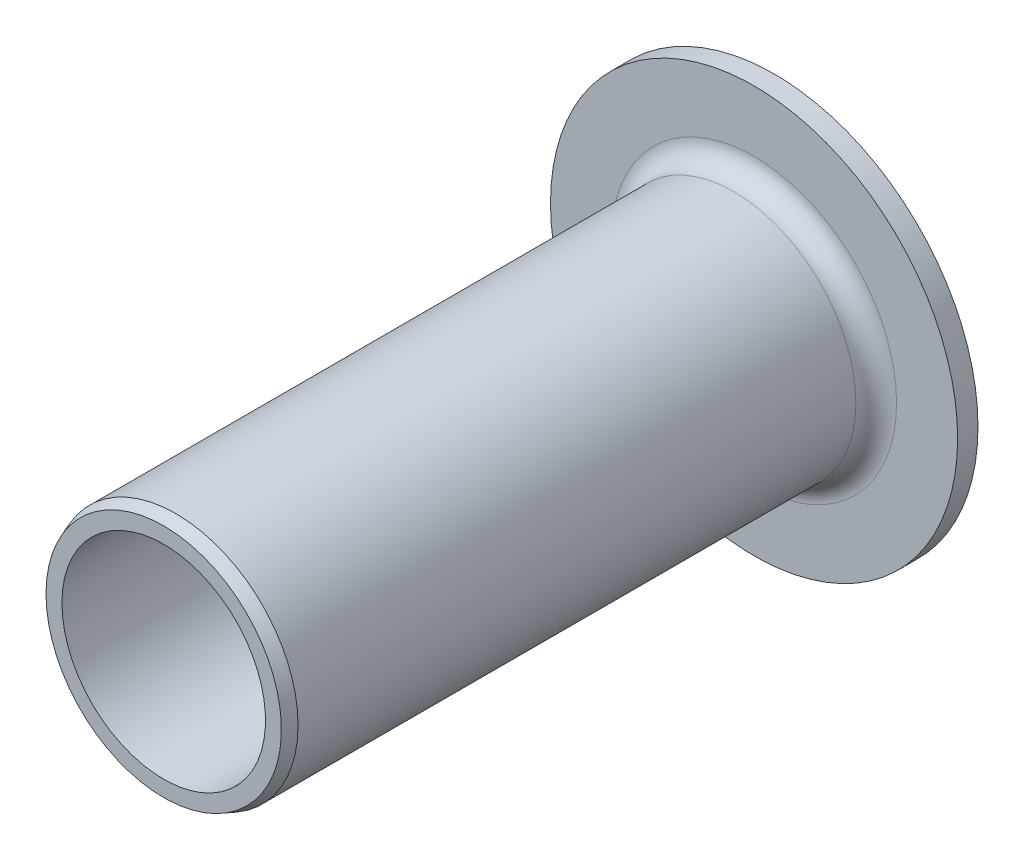
ISO-10303-21;
HEADER;
FILE_DESCRIPTION(('STEP AP214'),'2;1');
FILE_NAME('part.step','',(''),(''),'','','');
FILE_SCHEMA(('AUTOMOTIVE_DESIGN { 1 0 10303 214 1 1 1 1 }'));
ENDSEC;
DATA;
#1=APPLICATION_CONTEXT('core data for automotive mechanical design processes');
#2=APPLICATION_PROTOCOL_DEFINITION('international standard','automotive_design',2000,#1);
#3=PRODUCT_CONTEXT('',#1,'mechanical');
#4=PRODUCT('Part','Part','',(#3));
#5=PRODUCT_RELATED_PRODUCT_CATEGORY('part','',(#4));
#6=PRODUCT_DEFINITION_FORMATION('','',#4);
#7=PRODUCT_DEFINITION_CONTEXT('part definition',#1,'design');
#8=PRODUCT_DEFINITION('design','',#6,#7);
#9=PRODUCT_DEFINITION_SHAPE('','',#8);
#10=(LENGTH_UNIT() NAMED_UNIT(*) SI_UNIT(.MILLI.,.METRE.));
#11=(NAMED_UNIT(*) PLANE_ANGLE_UNIT() SI_UNIT($,.RADIAN.));
#12=(NAMED_UNIT(*) SI_UNIT($,.STERADIAN.) SOLID_ANGLE_UNIT());
#13=UNCERTAINTY_MEASURE_WITH_UNIT(LENGTH_MEASURE(1.E-05),#10,'distance_accuracy_value','');
#14=(GEOMETRIC_REPRESENTATION_CONTEXT(3) GLOBAL_UNCERTAINTY_ASSIGNED_CONTEXT((#13)) GLOBAL_UNIT_ASSIGNED_CONTEXT((#10,
#11,#12)) REPRESENTATION_CONTEXT('',''));
#15=CARTESIAN_POINT('',(0.,0.,0.));
#16=DIRECTION('',(0.,0.,1.));
#17=DIRECTION('',(1.,0.,0.));
#18=AXIS2_PLACEMENT_3D('',#15,#16,#17);
#19=CARTESIAN_POINT('',(3.75,0.,0.));
#20=DIRECTION('',(0.,0.,-1.));
#21=DIRECTION('',(-1.,0.,0.));
#22=AXIS2_PLACEMENT_3D('',#19,#20,#21);
#23=PLANE('',#22);
#24=CARTESIAN_POINT('',(0.,0.,0.));
#25=DIRECTION('',(0.,0.,-1.));
#26=DIRECTION('',(-1.,0.,0.));
#27=AXIS2_PLACEMENT_3D('',#24,#25,#26);
#28=CIRCLE('',#27,2.5);
#29=CARTESIAN_POINT('',(-2.5,0.,0.));
#30=VERTEX_POINT('',#29);
#31=EDGE_CURVE('E114',#30,#30,#28,.F.);
#32=ORIENTED_EDGE('',*,*,#31,.T.);
#33=EDGE_LOOP('',(#32));
#34=FACE_BOUND('',#33,.T.);
#35=CARTESIAN_POINT('',(0.,0.,0.));
#36=DIRECTION('',(0.,0.,-1.));
#37=DIRECTION('',(-1.,0.,0.));
#38=AXIS2_PLACEMENT_3D('',#35,#36,#37);
#39=CIRCLE('',#38,5.);
#40=CARTESIAN_POINT('',(-5.,0.,0.));
#41=VERTEX_POINT('',#40);
#42=EDGE_CURVE('E117',#41,#41,#39,.F.);
#43=ORIENTED_EDGE('',*,*,#42,.F.);
#44=EDGE_LOOP('',(#43));
#45=FACE_BOUND('',#44,.T.);
#46=ADVANCED_FACE('F15',(#34,#45),#23,.T.);
#47=CARTESIAN_POINT('',(0.,0.,0.25));
#48=DIRECTION('',(0.,0.,-1.));
#49=DIRECTION('',(-1.,0.,0.));
#50=AXIS2_PLACEMENT_3D('',#47,#48,#49);
#51=CYLINDRICAL_SURFACE('',#50,5.);
#52=CARTESIAN_POINT('',(0.,0.,0.5));
#53=DIRECTION('',(0.,0.,-1.));
#54=DIRECTION('',(-1.,0.,0.));
#55=AXIS2_PLACEMENT_3D('',#52,#53,#54);
#56=CIRCLE('',#55,5.);
#57=CARTESIAN_POINT('',(-5.,0.,0.5));
#58=VERTEX_POINT('',#57);
#59=EDGE_CURVE('E40',#58,#58,#56,.F.);
#60=ORIENTED_EDGE('',*,*,#59,.F.);
#61=EDGE_LOOP('',(#60));
#62=FACE_BOUND('',#61,.T.);
#63=ORIENTED_EDGE('',*,*,#42,.T.);
#64=EDGE_LOOP('',(#63));
#65=FACE_BOUND('',#64,.T.);
#66=ADVANCED_FACE('F84',(#62,#65),#51,.T.);
#67=CARTESIAN_POINT('',(0.,0.,7.5));
#68=DIRECTION('',(0.,0.,-1.));
#69=DIRECTION('',(-1.,0.,0.));
#70=AXIS2_PLACEMENT_3D('',#67,#68,#69);
#71=CYLINDRICAL_SURFACE('',#70,2.5);
#72=ORIENTED_EDGE('',*,*,#31,.F.);
#73=EDGE_LOOP('',(#72));
#74=FACE_BOUND('',#73,.T.);
#75=CARTESIAN_POINT('',(0.,0.,15.));
#76=DIRECTION('',(0.,0.,-1.));
#77=DIRECTION('',(-1.,0.,0.));
#78=AXIS2_PLACEMENT_3D('',#75,#76,#77);
#79=CIRCLE('',#78,2.5);
#80=CARTESIAN_POINT('',(-2.5,0.,15.));
#81=VERTEX_POINT('',#80);
#82=EDGE_CURVE('E39',#81,#81,#79,.T.);
#83=ORIENTED_EDGE('',*,*,#82,.F.);
#84=EDGE_LOOP('',(#83));
#85=FACE_BOUND('',#84,.T.);
#86=ADVANCED_FACE('F80',(#74,#85),#71,.F.);
#87=CARTESIAN_POINT('',(4.25,0.,0.5));
#88=DIRECTION('',(0.,0.,1.));
#89=DIRECTION('',(1.,0.,0.));
#90=AXIS2_PLACEMENT_3D('',#87,#88,#89);
#91=PLANE('',#90);
#92=ORIENTED_EDGE('',*,*,#59,.T.);
#93=EDGE_LOOP('',(#92));
#94=FACE_BOUND('',#93,.T.);
#95=CARTESIAN_POINT('',(0.,0.,0.499999999999999));
#96=DIRECTION('',(0.,0.,1.));
#97=DIRECTION('',(1.,0.,0.));
#98=AXIS2_PLACEMENT_3D('',#95,#96,#97);
#99=CIRCLE('',#98,3.5);
#100=CARTESIAN_POINT('',(-3.5,0.,0.499999999999999));
#101=VERTEX_POINT('',#100);
#102=CARTESIAN_POINT('',(3.5,0.,0.499999999999999));
#103=VERTEX_POINT('',#102);
#104=EDGE_CURVE('E32',#101,#103,#99,.F.);
#105=ORIENTED_EDGE('',*,*,#104,.T.);
#106=CARTESIAN_POINT('',(0.,0.,0.499999999999999));
#107=DIRECTION('',(0.,0.,1.));
#108=DIRECTION('',(-1.,0.,0.));
#109=AXIS2_PLACEMENT_3D('',#106,#107,#108);
#110=CIRCLE('',#109,3.5);
#111=EDGE_CURVE('E35',#103,#101,#110,.F.);
#112=ORIENTED_EDGE('',*,*,#111,.T.);
#113=EDGE_LOOP('',(#105,#112));
#114=FACE_BOUND('',#113,.T.);
#115=ADVANCED_FACE('F37',(#94,#114),#91,.T.);
#116=CARTESIAN_POINT('',(2.69540446486007,0.,15.));
#117=DIRECTION('',(0.,0.,1.));
#118=DIRECTION('',(1.,0.,0.));
#119=AXIS2_PLACEMENT_3D('',#116,#117,#118);
#120=PLANE('',#119);
#121=CARTESIAN_POINT('',(0.,0.,14.9999999999864));
#122=DIRECTION('',(0.,0.,-1.));
#123=DIRECTION('',(-1.,0.,0.));
#124=AXIS2_PLACEMENT_3D('',#121,#122,#123);
#125=CIRCLE('',#124,2.89080892974629);
#126=CARTESIAN_POINT('',(-2.89080892974629,0.,14.9999999999864));
#127=VERTEX_POINT('',#126);
#128=EDGE_CURVE('E45',#127,#127,#125,.T.);
#129=ORIENTED_EDGE('',*,*,#128,.F.);
#130=EDGE_LOOP('',(#129));
#131=FACE_BOUND('',#130,.T.);
#132=ORIENTED_EDGE('',*,*,#82,.T.);
#133=EDGE_LOOP('',(#132));
#134=FACE_BOUND('',#133,.T.);
#135=ADVANCED_FACE('F64',(#131,#134),#120,.T.);
#136=CARTESIAN_POINT('',(0.,0.,1.));
#137=DIRECTION('',(0.,0.,1.));
#138=DIRECTION('',(1.,0.,0.));
#139=AXIS2_PLACEMENT_3D('',#136,#137,#138);
#140=TOROIDAL_SURFACE('',#139,3.5,0.500000000000001);
#141=CARTESIAN_POINT('',(0.,0.,1.));
#142=DIRECTION('',(0.,0.,-1.));
#143=DIRECTION('',(-1.,0.,0.));
#144=AXIS2_PLACEMENT_3D('',#141,#142,#143);
#145=CIRCLE('',#144,3.);
#146=CARTESIAN_POINT('',(-3.,0.,1.));
#147=VERTEX_POINT('',#146);
#148=EDGE_CURVE('E25',#147,#147,#145,.F.);
#149=ORIENTED_EDGE('',*,*,#148,.F.);
#150=EDGE_LOOP('',(#149));
#151=FACE_BOUND('',#150,.T.);
#152=ORIENTED_EDGE('',*,*,#111,.F.);
#153=ORIENTED_EDGE('',*,*,#104,.F.);
#154=EDGE_LOOP('',(#152,#153));
#155=FACE_BOUND('',#154,.T.);
#156=ADVANCED_FACE('F44',(#151,#155),#140,.F.);
#157=CARTESIAN_POINT('',(0.,0.,14.7000000000617));
#158=DIRECTION('',(0.,0.,-1.));
#159=DIRECTION('',(-1.,0.,0.));
#160=AXIS2_PLACEMENT_3D('',#157,#158,#159);
#161=CONICAL_SURFACE('',#160,3.00000000001432,0.349065850444726);
#162=ORIENTED_EDGE('',*,*,#128,.T.);
#163=EDGE_LOOP('',(#162));
#164=FACE_BOUND('',#163,.T.);
#165=CARTESIAN_POINT('',(0.,0.,14.7));
#166=DIRECTION('',(0.,0.,-1.));
#167=DIRECTION('',(-1.,0.,0.));
#168=AXIS2_PLACEMENT_3D('',#165,#166,#167);
#169=CIRCLE('',#168,3.);
#170=CARTESIAN_POINT('',(-3.,0.,14.7));
#171=VERTEX_POINT('',#170);
#172=EDGE_CURVE('E10',#171,#171,#169,.T.);
#173=ORIENTED_EDGE('',*,*,#172,.F.);
#174=EDGE_LOOP('',(#173));
#175=FACE_BOUND('',#174,.T.);
#176=ADVANCED_FACE('F63',(#164,#175),#161,.T.);
#177=CARTESIAN_POINT('',(0.,0.,7.85));
#178=DIRECTION('',(0.,0.,-1.));
#179=DIRECTION('',(-1.,0.,0.));
#180=AXIS2_PLACEMENT_3D('',#177,#178,#179);
#181=CYLINDRICAL_SURFACE('',#180,3.);
#182=ORIENTED_EDGE('',*,*,#148,.T.);
#183=EDGE_LOOP('',(#182));
#184=FACE_BOUND('',#183,.T.);
#185=ORIENTED_EDGE('',*,*,#172,.T.);
#186=EDGE_LOOP('',(#185));
#187=FACE_BOUND('',#186,.T.);
#188=ADVANCED_FACE('F95',(#184,#187),#181,.T.);
#189=CLOSED_SHELL('',(#46,#66,#86,#115,#135,#156,#176,#188));
#190=MANIFOLD_SOLID_BREP('B1',#189);
#191=ADVANCED_BREP_SHAPE_REPRESENTATION('',(#18,#190),#14);
#192=SHAPE_DEFINITION_REPRESENTATION(#9,#191);
ENDSEC;
END-ISO-10303-21;
